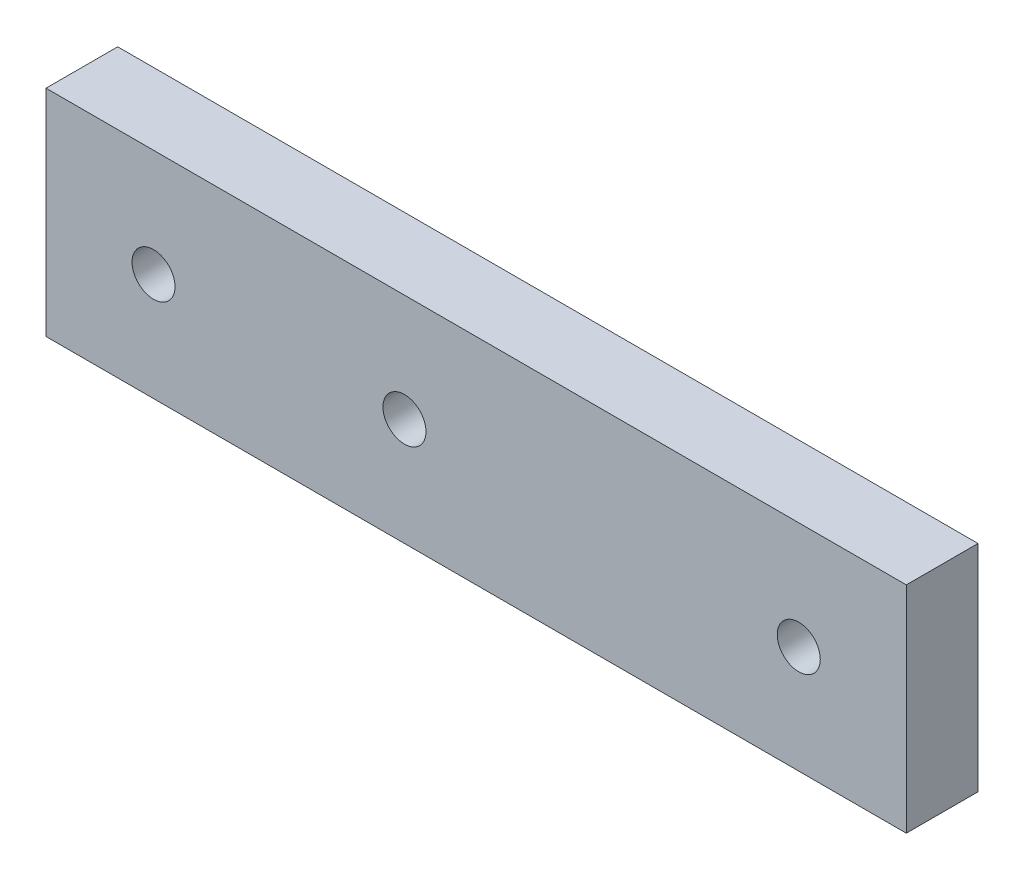
ISO-10303-21;
HEADER;
FILE_DESCRIPTION(('STEP AP214'),'2;1');
FILE_NAME('part.step','',(''),(''),'','','');
FILE_SCHEMA(('AUTOMOTIVE_DESIGN { 1 0 10303 214 1 1 1 1 }'));
ENDSEC;
DATA;
#1=APPLICATION_CONTEXT('core data for automotive mechanical design processes');
#2=APPLICATION_PROTOCOL_DEFINITION('international standard','automotive_design',2000,#1);
#3=PRODUCT_CONTEXT('',#1,'mechanical');
#4=PRODUCT('Part','Part','',(#3));
#5=PRODUCT_RELATED_PRODUCT_CATEGORY('part','',(#4));
#6=PRODUCT_DEFINITION_FORMATION('','',#4);
#7=PRODUCT_DEFINITION_CONTEXT('part definition',#1,'design');
#8=PRODUCT_DEFINITION('design','',#6,#7);
#9=PRODUCT_DEFINITION_SHAPE('','',#8);
#10=(LENGTH_UNIT() NAMED_UNIT(*) SI_UNIT(.MILLI.,.METRE.));
#11=(NAMED_UNIT(*) PLANE_ANGLE_UNIT() SI_UNIT($,.RADIAN.));
#12=(NAMED_UNIT(*) SI_UNIT($,.STERADIAN.) SOLID_ANGLE_UNIT());
#13=UNCERTAINTY_MEASURE_WITH_UNIT(LENGTH_MEASURE(1.E-05),#10,'distance_accuracy_value','');
#14=(GEOMETRIC_REPRESENTATION_CONTEXT(3) GLOBAL_UNCERTAINTY_ASSIGNED_CONTEXT((#13)) GLOBAL_UNIT_ASSIGNED_CONTEXT((#10,
#11,#12)) REPRESENTATION_CONTEXT('',''));
#15=CARTESIAN_POINT('',(0.,0.,0.));
#16=DIRECTION('',(0.,0.,1.));
#17=DIRECTION('',(1.,0.,0.));
#18=AXIS2_PLACEMENT_3D('',#15,#16,#17);
#19=CARTESIAN_POINT('',(0.,0.,5.));
#20=DIRECTION('',(0.,0.,1.));
#21=DIRECTION('',(1.,0.,0.));
#22=AXIS2_PLACEMENT_3D('',#19,#20,#21);
#23=PLANE('',#22);
#24=CARTESIAN_POINT('',(-35.,7.5,5.));
#25=DIRECTION('',(0.,0.,1.));
#26=DIRECTION('',(1.,0.,0.));
#27=AXIS2_PLACEMENT_3D('',#24,#25,#26);
#28=CIRCLE('',#27,1.5);
#29=CARTESIAN_POINT('',(-33.5,7.5,5.));
#30=VERTEX_POINT('',#29);
#31=EDGE_CURVE('E134',#30,#30,#28,.T.);
#32=ORIENTED_EDGE('',*,*,#31,.F.);
#33=EDGE_LOOP('',(#32));
#34=FACE_BOUND('',#33,.T.);
#35=DIRECTION('',(0.,1.,0.));
#36=VECTOR('',#35,1.);
#37=CARTESIAN_POINT('',(0.,0.,5.));
#38=LINE('',#37,#36);
#39=CARTESIAN_POINT('',(0.,0.,5.));
#40=VERTEX_POINT('',#39);
#41=CARTESIAN_POINT('',(0.,15.,5.));
#42=VERTEX_POINT('',#41);
#43=EDGE_CURVE('E92',#40,#42,#38,.T.);
#44=ORIENTED_EDGE('',*,*,#43,.T.);
#45=DIRECTION('',(-1.,0.,0.));
#46=VECTOR('',#45,1.);
#47=CARTESIAN_POINT('',(0.,15.,5.));
#48=LINE('',#47,#46);
#49=CARTESIAN_POINT('',(-60.,15.,5.));
#50=VERTEX_POINT('',#49);
#51=EDGE_CURVE('E87',#42,#50,#48,.T.);
#52=ORIENTED_EDGE('',*,*,#51,.T.);
#53=DIRECTION('',(0.,-1.,0.));
#54=VECTOR('',#53,1.);
#55=CARTESIAN_POINT('',(-60.,0.,5.));
#56=LINE('',#55,#54);
#57=CARTESIAN_POINT('',(-60.,0.,5.));
#58=VERTEX_POINT('',#57);
#59=EDGE_CURVE('E90',#50,#58,#56,.T.);
#60=ORIENTED_EDGE('',*,*,#59,.T.);
#61=DIRECTION('',(1.,0.,0.));
#62=VECTOR('',#61,1.);
#63=CARTESIAN_POINT('',(0.,0.,5.));
#64=LINE('',#63,#62);
#65=EDGE_CURVE('E57',#58,#40,#64,.T.);
#66=ORIENTED_EDGE('',*,*,#65,.T.);
#67=EDGE_LOOP('',(#44,#52,#60,#66));
#68=FACE_BOUND('',#67,.T.);
#69=CARTESIAN_POINT('',(-52.5,7.49999999999999,5.));
#70=DIRECTION('',(0.,0.,1.));
#71=DIRECTION('',(1.,0.,0.));
#72=AXIS2_PLACEMENT_3D('',#69,#70,#71);
#73=CIRCLE('',#72,1.5);
#74=CARTESIAN_POINT('',(-51.,7.49999999999999,5.));
#75=VERTEX_POINT('',#74);
#76=EDGE_CURVE('E112',#75,#75,#73,.T.);
#77=ORIENTED_EDGE('',*,*,#76,.F.);
#78=EDGE_LOOP('',(#77));
#79=FACE_BOUND('',#78,.T.);
#80=CARTESIAN_POINT('',(-7.5,7.5,5.));
#81=DIRECTION('',(0.,0.,1.));
#82=DIRECTION('',(1.,0.,0.));
#83=AXIS2_PLACEMENT_3D('',#80,#81,#82);
#84=CIRCLE('',#83,1.5);
#85=CARTESIAN_POINT('',(-6.,7.5,5.));
#86=VERTEX_POINT('',#85);
#87=EDGE_CURVE('E142',#86,#86,#84,.T.);
#88=ORIENTED_EDGE('',*,*,#87,.F.);
#89=EDGE_LOOP('',(#88));
#90=FACE_BOUND('',#89,.T.);
#91=ADVANCED_FACE('F39',(#34,#68,#79,#90),#23,.T.);
#92=CARTESIAN_POINT('',(0.,0.,0.));
#93=DIRECTION('',(0.,0.,1.));
#94=DIRECTION('',(1.,0.,0.));
#95=AXIS2_PLACEMENT_3D('',#92,#93,#94);
#96=PLANE('',#95);
#97=DIRECTION('',(0.,1.,0.));
#98=VECTOR('',#97,1.);
#99=CARTESIAN_POINT('',(0.,0.,0.));
#100=LINE('',#99,#98);
#101=CARTESIAN_POINT('',(0.,0.,0.));
#102=VERTEX_POINT('',#101);
#103=CARTESIAN_POINT('',(0.,15.,0.));
#104=VERTEX_POINT('',#103);
#105=EDGE_CURVE('E108',#102,#104,#100,.T.);
#106=ORIENTED_EDGE('',*,*,#105,.F.);
#107=DIRECTION('',(1.,0.,0.));
#108=VECTOR('',#107,1.);
#109=CARTESIAN_POINT('',(0.,0.,0.));
#110=LINE('',#109,#108);
#111=CARTESIAN_POINT('',(-60.,0.,0.));
#112=VERTEX_POINT('',#111);
#113=EDGE_CURVE('E80',#112,#102,#110,.T.);
#114=ORIENTED_EDGE('',*,*,#113,.F.);
#115=DIRECTION('',(0.,-1.,0.));
#116=VECTOR('',#115,1.);
#117=CARTESIAN_POINT('',(-60.,0.,0.));
#118=LINE('',#117,#116);
#119=CARTESIAN_POINT('',(-60.,15.,0.));
#120=VERTEX_POINT('',#119);
#121=EDGE_CURVE('E74',#120,#112,#118,.T.);
#122=ORIENTED_EDGE('',*,*,#121,.F.);
#123=DIRECTION('',(-1.,0.,0.));
#124=VECTOR('',#123,1.);
#125=CARTESIAN_POINT('',(0.,15.,0.));
#126=LINE('',#125,#124);
#127=EDGE_CURVE('E97',#104,#120,#126,.T.);
#128=ORIENTED_EDGE('',*,*,#127,.F.);
#129=EDGE_LOOP('',(#106,#114,#122,#128));
#130=FACE_BOUND('',#129,.T.);
#131=CARTESIAN_POINT('',(-52.5,7.49999999999999,0.));
#132=DIRECTION('',(0.,0.,1.));
#133=DIRECTION('',(1.,0.,0.));
#134=AXIS2_PLACEMENT_3D('',#131,#132,#133);
#135=CIRCLE('',#134,1.5);
#136=CARTESIAN_POINT('',(-51.,7.49999999999999,0.));
#137=VERTEX_POINT('',#136);
#138=EDGE_CURVE('E130',#137,#137,#135,.T.);
#139=ORIENTED_EDGE('',*,*,#138,.T.);
#140=EDGE_LOOP('',(#139));
#141=FACE_BOUND('',#140,.T.);
#142=CARTESIAN_POINT('',(-35.,7.5,0.));
#143=DIRECTION('',(0.,0.,1.));
#144=DIRECTION('',(1.,0.,0.));
#145=AXIS2_PLACEMENT_3D('',#142,#143,#144);
#146=CIRCLE('',#145,1.5);
#147=CARTESIAN_POINT('',(-33.5,7.5,0.));
#148=VERTEX_POINT('',#147);
#149=EDGE_CURVE('E138',#148,#148,#146,.T.);
#150=ORIENTED_EDGE('',*,*,#149,.T.);
#151=EDGE_LOOP('',(#150));
#152=FACE_BOUND('',#151,.T.);
#153=CARTESIAN_POINT('',(-7.5,7.5,0.));
#154=DIRECTION('',(0.,0.,1.));
#155=DIRECTION('',(1.,0.,0.));
#156=AXIS2_PLACEMENT_3D('',#153,#154,#155);
#157=CIRCLE('',#156,1.5);
#158=CARTESIAN_POINT('',(-6.,7.5,0.));
#159=VERTEX_POINT('',#158);
#160=EDGE_CURVE('E146',#159,#159,#157,.T.);
#161=ORIENTED_EDGE('',*,*,#160,.T.);
#162=EDGE_LOOP('',(#161));
#163=FACE_BOUND('',#162,.T.);
#164=ADVANCED_FACE('F125',(#130,#141,#152,#163),#96,.F.);
#165=CARTESIAN_POINT('',(0.,0.,5.));
#166=DIRECTION('',(-1.,0.,0.));
#167=DIRECTION('',(0.,-1.,0.));
#168=AXIS2_PLACEMENT_3D('',#165,#166,#167);
#169=PLANE('',#168);
#170=ORIENTED_EDGE('',*,*,#105,.T.);
#171=DIRECTION('',(0.,0.,-1.));
#172=VECTOR('',#171,1.);
#173=CARTESIAN_POINT('',(0.,15.,5.));
#174=LINE('',#173,#172);
#175=EDGE_CURVE('E11',#42,#104,#174,.T.);
#176=ORIENTED_EDGE('',*,*,#175,.F.);
#177=ORIENTED_EDGE('',*,*,#43,.F.);
#178=DIRECTION('',(0.,0.,-1.));
#179=VECTOR('',#178,1.);
#180=CARTESIAN_POINT('',(0.,0.,5.));
#181=LINE('',#180,#179);
#182=EDGE_CURVE('E104',#40,#102,#181,.T.);
#183=ORIENTED_EDGE('',*,*,#182,.T.);
#184=EDGE_LOOP('',(#170,#176,#177,#183));
#185=FACE_BOUND('',#184,.T.);
#186=ADVANCED_FACE('F41',(#185),#169,.F.);
#187=CARTESIAN_POINT('',(0.,15.,5.));
#188=DIRECTION('',(0.,-1.,0.));
#189=DIRECTION('',(1.,0.,0.));
#190=AXIS2_PLACEMENT_3D('',#187,#188,#189);
#191=PLANE('',#190);
#192=ORIENTED_EDGE('',*,*,#127,.T.);
#193=DIRECTION('',(0.,0.,-1.));
#194=VECTOR('',#193,1.);
#195=CARTESIAN_POINT('',(-60.,15.,5.));
#196=LINE('',#195,#194);
#197=EDGE_CURVE('E49',#50,#120,#196,.T.);
#198=ORIENTED_EDGE('',*,*,#197,.F.);
#199=ORIENTED_EDGE('',*,*,#51,.F.);
#200=ORIENTED_EDGE('',*,*,#175,.T.);
#201=EDGE_LOOP('',(#192,#198,#199,#200));
#202=FACE_BOUND('',#201,.T.);
#203=ADVANCED_FACE('F96',(#202),#191,.F.);
#204=CARTESIAN_POINT('',(-60.,0.,5.));
#205=DIRECTION('',(1.,0.,0.));
#206=DIRECTION('',(0.,0.,-1.));
#207=AXIS2_PLACEMENT_3D('',#204,#205,#206);
#208=PLANE('',#207);
#209=ORIENTED_EDGE('',*,*,#121,.T.);
#210=DIRECTION('',(0.,0.,-1.));
#211=VECTOR('',#210,1.);
#212=CARTESIAN_POINT('',(-60.,0.,5.));
#213=LINE('',#212,#211);
#214=EDGE_CURVE('E99',#58,#112,#213,.T.);
#215=ORIENTED_EDGE('',*,*,#214,.F.);
#216=ORIENTED_EDGE('',*,*,#59,.F.);
#217=ORIENTED_EDGE('',*,*,#197,.T.);
#218=EDGE_LOOP('',(#209,#215,#216,#217));
#219=FACE_BOUND('',#218,.T.);
#220=ADVANCED_FACE('F100',(#219),#208,.F.);
#221=CARTESIAN_POINT('',(0.,0.,5.));
#222=DIRECTION('',(0.,1.,0.));
#223=DIRECTION('',(-1.,0.,0.));
#224=AXIS2_PLACEMENT_3D('',#221,#222,#223);
#225=PLANE('',#224);
#226=ORIENTED_EDGE('',*,*,#113,.T.);
#227=ORIENTED_EDGE('',*,*,#182,.F.);
#228=ORIENTED_EDGE('',*,*,#65,.F.);
#229=ORIENTED_EDGE('',*,*,#214,.T.);
#230=EDGE_LOOP('',(#226,#227,#228,#229));
#231=FACE_BOUND('',#230,.T.);
#232=ADVANCED_FACE('F122',(#231),#225,.F.);
#233=CARTESIAN_POINT('',(-52.5,7.49999999999999,5.));
#234=DIRECTION('',(0.,0.,-1.));
#235=DIRECTION('',(-1.,0.,0.));
#236=AXIS2_PLACEMENT_3D('',#233,#234,#235);
#237=CYLINDRICAL_SURFACE('',#236,1.5);
#238=ORIENTED_EDGE('',*,*,#76,.T.);
#239=EDGE_LOOP('',(#238));
#240=FACE_BOUND('',#239,.T.);
#241=ORIENTED_EDGE('',*,*,#138,.F.);
#242=EDGE_LOOP('',(#241));
#243=FACE_BOUND('',#242,.T.);
#244=ADVANCED_FACE('F166',(#240,#243),#237,.F.);
#245=CARTESIAN_POINT('',(-35.,7.5,5.));
#246=DIRECTION('',(0.,0.,-1.));
#247=DIRECTION('',(-1.,0.,0.));
#248=AXIS2_PLACEMENT_3D('',#245,#246,#247);
#249=CYLINDRICAL_SURFACE('',#248,1.5);
#250=ORIENTED_EDGE('',*,*,#31,.T.);
#251=EDGE_LOOP('',(#250));
#252=FACE_BOUND('',#251,.T.);
#253=ORIENTED_EDGE('',*,*,#149,.F.);
#254=EDGE_LOOP('',(#253));
#255=FACE_BOUND('',#254,.T.);
#256=ADVANCED_FACE('F212',(#252,#255),#249,.F.);
#257=CARTESIAN_POINT('',(-7.5,7.5,5.));
#258=DIRECTION('',(0.,0.,-1.));
#259=DIRECTION('',(-1.,0.,0.));
#260=AXIS2_PLACEMENT_3D('',#257,#258,#259);
#261=CYLINDRICAL_SURFACE('',#260,1.5);
#262=ORIENTED_EDGE('',*,*,#87,.T.);
#263=EDGE_LOOP('',(#262));
#264=FACE_BOUND('',#263,.T.);
#265=ORIENTED_EDGE('',*,*,#160,.F.);
#266=EDGE_LOOP('',(#265));
#267=FACE_BOUND('',#266,.T.);
#268=ADVANCED_FACE('F154',(#264,#267),#261,.F.);
#269=CLOSED_SHELL('',(#91,#164,#186,#203,#220,#232,#244,#256,#268));
#270=MANIFOLD_SOLID_BREP('B2',#269);
#271=ADVANCED_BREP_SHAPE_REPRESENTATION('',(#18,#270),#14);
#272=SHAPE_DEFINITION_REPRESENTATION(#9,#271);
ENDSEC;
END-ISO-10303-21;
